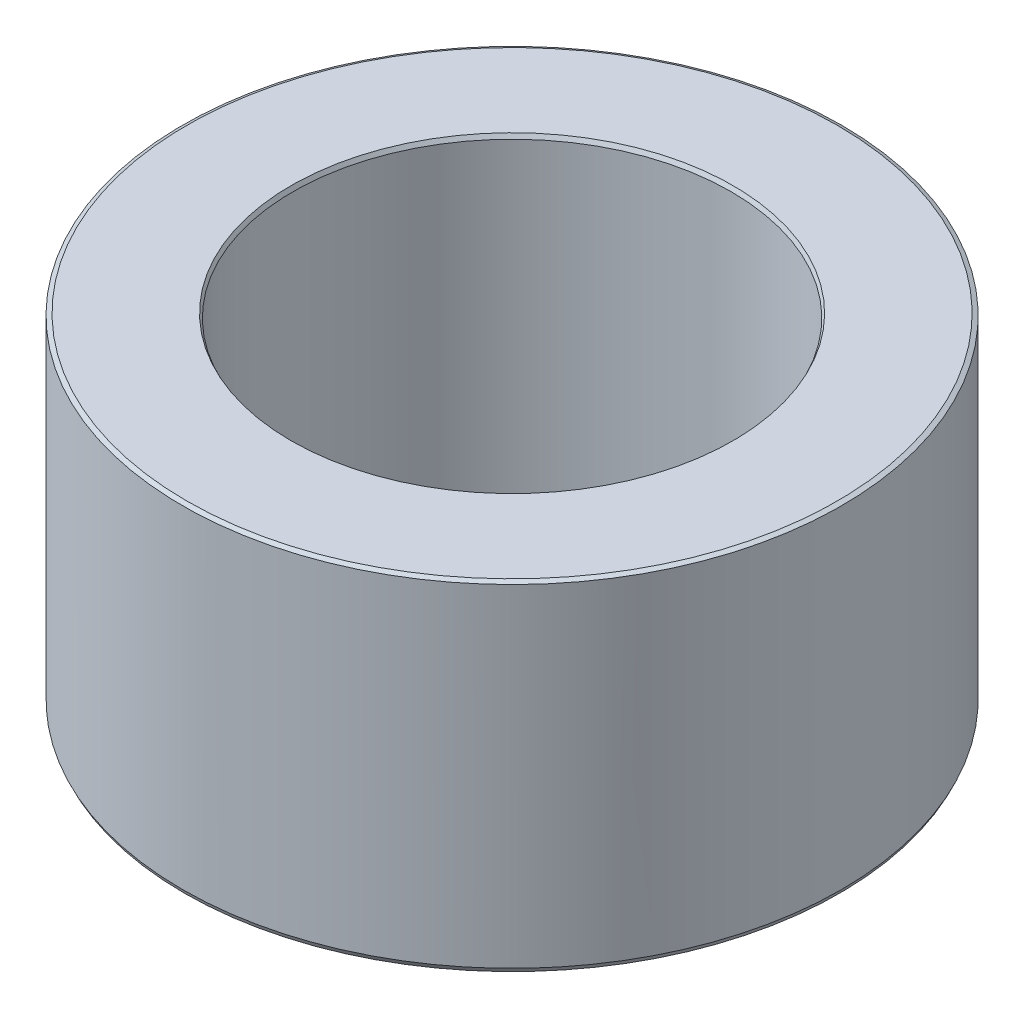
ISO-10303-21;
HEADER;
FILE_DESCRIPTION(('STEP AP214'),'2;1');
FILE_NAME('part.step','',(''),(''),'','','');
FILE_SCHEMA(('AUTOMOTIVE_DESIGN { 1 0 10303 214 1 1 1 1 }'));
ENDSEC;
DATA;
#1=APPLICATION_CONTEXT('core data for automotive mechanical design processes');
#2=APPLICATION_PROTOCOL_DEFINITION('international standard','automotive_design',2000,#1);
#3=PRODUCT_CONTEXT('',#1,'mechanical');
#4=PRODUCT('Part','Part','',(#3));
#5=PRODUCT_RELATED_PRODUCT_CATEGORY('part','',(#4));
#6=PRODUCT_DEFINITION_FORMATION('','',#4);
#7=PRODUCT_DEFINITION_CONTEXT('part definition',#1,'design');
#8=PRODUCT_DEFINITION('design','',#6,#7);
#9=PRODUCT_DEFINITION_SHAPE('','',#8);
#10=(LENGTH_UNIT() NAMED_UNIT(*) SI_UNIT(.MILLI.,.METRE.));
#11=(NAMED_UNIT(*) PLANE_ANGLE_UNIT() SI_UNIT($,.RADIAN.));
#12=(NAMED_UNIT(*) SI_UNIT($,.STERADIAN.) SOLID_ANGLE_UNIT());
#13=UNCERTAINTY_MEASURE_WITH_UNIT(LENGTH_MEASURE(1.E-05),#10,'distance_accuracy_value','');
#14=(GEOMETRIC_REPRESENTATION_CONTEXT(3) GLOBAL_UNCERTAINTY_ASSIGNED_CONTEXT((#13)) GLOBAL_UNIT_ASSIGNED_CONTEXT((#10,
#11,#12)) REPRESENTATION_CONTEXT('',''));
#15=CARTESIAN_POINT('',(0.,0.,0.));
#16=DIRECTION('',(0.,0.,1.));
#17=DIRECTION('',(1.,0.,0.));
#18=AXIS2_PLACEMENT_3D('',#15,#16,#17);
#19=CARTESIAN_POINT('',(0.,41.0965791067413,0.));
#20=DIRECTION('',(0.,-1.,0.));
#21=DIRECTION('',(0.,0.,-1.));
#22=AXIS2_PLACEMENT_3D('',#19,#20,#21);
#23=CYLINDRICAL_SURFACE('',#22,40.);
#24=CARTESIAN_POINT('',(0.,0.514580159419575,0.));
#25=DIRECTION('',(0.,1.,0.));
#26=DIRECTION('',(0.,0.,1.));
#27=AXIS2_PLACEMENT_3D('',#24,#25,#26);
#28=CIRCLE('',#27,40.);
#29=CARTESIAN_POINT('',(0.,0.514580159419575,40.));
#30=VERTEX_POINT('',#29);
#31=EDGE_CURVE('E10',#30,#30,#28,.T.);
#32=ORIENTED_EDGE('',*,*,#31,.T.);
#33=EDGE_LOOP('',(#32));
#34=FACE_BOUND('',#33,.T.);
#35=CARTESIAN_POINT('',(0.,40.8561418525905,0.));
#36=DIRECTION('',(0.,1.,0.));
#37=DIRECTION('',(0.,0.,1.));
#38=AXIS2_PLACEMENT_3D('',#35,#36,#37);
#39=CIRCLE('',#38,40.);
#40=CARTESIAN_POINT('',(0.,40.8561418525905,-40.));
#41=VERTEX_POINT('',#40);
#42=EDGE_CURVE('E50',#41,#41,#39,.F.);
#43=ORIENTED_EDGE('',*,*,#42,.T.);
#44=EDGE_LOOP('',(#43));
#45=FACE_BOUND('',#44,.T.);
#46=ADVANCED_FACE('F39',(#34,#45),#23,.T.);
#47=CARTESIAN_POINT('',(0.,41.0965791067413,0.));
#48=DIRECTION('',(0.,1.,0.));
#49=DIRECTION('',(0.,0.,1.));
#50=AXIS2_PLACEMENT_3D('',#47,#48,#49);
#51=PLANE('',#50);
#52=CARTESIAN_POINT('',(0.,41.0965791067413,0.));
#53=DIRECTION('',(0.,1.,0.));
#54=DIRECTION('',(0.,0.,1.));
#55=AXIS2_PLACEMENT_3D('',#52,#53,#54);
#56=CIRCLE('',#55,26.8243624356126);
#57=CARTESIAN_POINT('',(0.,41.0965791067413,26.8243624356126));
#58=VERTEX_POINT('',#57);
#59=EDGE_CURVE('E58',#58,#58,#56,.F.);
#60=ORIENTED_EDGE('',*,*,#59,.T.);
#61=EDGE_LOOP('',(#60));
#62=FACE_BOUND('',#61,.T.);
#63=CARTESIAN_POINT('',(0.,41.0965791067413,0.));
#64=DIRECTION('',(0.,1.,0.));
#65=DIRECTION('',(0.,0.,1.));
#66=AXIS2_PLACEMENT_3D('',#63,#64,#65);
#67=CIRCLE('',#66,39.4854198405805);
#68=CARTESIAN_POINT('',(0.,41.0965791067413,-39.4854198405805));
#69=VERTEX_POINT('',#68);
#70=EDGE_CURVE('E61',#69,#69,#67,.T.);
#71=ORIENTED_EDGE('',*,*,#70,.T.);
#72=EDGE_LOOP('',(#71));
#73=FACE_BOUND('',#72,.T.);
#74=ADVANCED_FACE('F88',(#62,#73),#51,.T.);
#75=CARTESIAN_POINT('',(0.,0.,0.));
#76=DIRECTION('',(0.,1.,0.));
#77=DIRECTION('',(0.,0.,1.));
#78=AXIS2_PLACEMENT_3D('',#75,#76,#77);
#79=PLANE('',#78);
#80=CARTESIAN_POINT('',(0.,0.,0.));
#81=DIRECTION('',(0.,1.,0.));
#82=DIRECTION('',(0.,0.,1.));
#83=AXIS2_PLACEMENT_3D('',#80,#81,#82);
#84=CIRCLE('',#83,27.0985053408813);
#85=CARTESIAN_POINT('',(0.,0.,-27.0985053408813));
#86=VERTEX_POINT('',#85);
#87=EDGE_CURVE('E51',#86,#86,#84,.T.);
#88=ORIENTED_EDGE('',*,*,#87,.T.);
#89=EDGE_LOOP('',(#88));
#90=FACE_BOUND('',#89,.T.);
#91=CARTESIAN_POINT('',(0.,0.,0.));
#92=DIRECTION('',(0.,1.,0.));
#93=DIRECTION('',(0.,0.,1.));
#94=AXIS2_PLACEMENT_3D('',#91,#92,#93);
#95=CIRCLE('',#94,39.7595627458491);
#96=CARTESIAN_POINT('',(0.,0.,39.7595627458491));
#97=VERTEX_POINT('',#96);
#98=EDGE_CURVE('E54',#97,#97,#95,.F.);
#99=ORIENTED_EDGE('',*,*,#98,.T.);
#100=EDGE_LOOP('',(#99));
#101=FACE_BOUND('',#100,.T.);
#102=ADVANCED_FACE('F83',(#90,#101),#79,.F.);
#103=CARTESIAN_POINT('',(0.,41.0965791067413,0.));
#104=DIRECTION('',(0.,-1.,0.));
#105=DIRECTION('',(0.,0.,-1.));
#106=AXIS2_PLACEMENT_3D('',#103,#104,#105);
#107=CYLINDRICAL_SURFACE('',#106,26.5839251814618);
#108=CARTESIAN_POINT('',(0.,40.5819989473218,0.));
#109=DIRECTION('',(0.,1.,0.));
#110=DIRECTION('',(0.,0.,1.));
#111=AXIS2_PLACEMENT_3D('',#108,#109,#110);
#112=CIRCLE('',#111,26.5839251814618);
#113=CARTESIAN_POINT('',(0.,40.5819989473218,26.5839251814618));
#114=VERTEX_POINT('',#113);
#115=EDGE_CURVE('E67',#114,#114,#112,.T.);
#116=ORIENTED_EDGE('',*,*,#115,.T.);
#117=EDGE_LOOP('',(#116));
#118=FACE_BOUND('',#117,.T.);
#119=CARTESIAN_POINT('',(0.,0.240437254150842,0.));
#120=DIRECTION('',(0.,1.,0.));
#121=DIRECTION('',(0.,0.,1.));
#122=AXIS2_PLACEMENT_3D('',#119,#120,#121);
#123=CIRCLE('',#122,26.5839251814618);
#124=CARTESIAN_POINT('',(0.,0.240437254150842,-26.5839251814618));
#125=VERTEX_POINT('',#124);
#126=EDGE_CURVE('E69',#125,#125,#123,.F.);
#127=ORIENTED_EDGE('',*,*,#126,.T.);
#128=EDGE_LOOP('',(#127));
#129=FACE_BOUND('',#128,.T.);
#130=ADVANCED_FACE('F71',(#118,#129),#107,.F.);
#131=CARTESIAN_POINT('',(0.,40.5819989473218,0.));
#132=DIRECTION('',(0.,1.,0.));
#133=DIRECTION('',(0.,0.,1.));
#134=AXIS2_PLACEMENT_3D('',#131,#132,#133);
#135=CONICAL_SURFACE('',#134,26.5839251814618,0.43710554837761);
#136=ORIENTED_EDGE('',*,*,#59,.F.);
#137=EDGE_LOOP('',(#136));
#138=FACE_BOUND('',#137,.T.);
#139=ORIENTED_EDGE('',*,*,#115,.F.);
#140=EDGE_LOOP('',(#139));
#141=FACE_BOUND('',#140,.T.);
#142=ADVANCED_FACE('F77',(#138,#141),#135,.F.);
#143=CARTESIAN_POINT('',(0.,0.,0.));
#144=DIRECTION('',(0.,-1.,0.));
#145=DIRECTION('',(0.,0.,-1.));
#146=AXIS2_PLACEMENT_3D('',#143,#144,#145);
#147=CONICAL_SURFACE('',#146,27.0985053408813,1.1336907784173);
#148=CARTESIAN_POINT('',(0.,0.240437254150842,-26.5839251814618));
#149=CARTESIAN_POINT('',(0.,0.237932699420104,-26.5892853914557));
#150=CARTESIAN_POINT('',(0.,0.235428144689366,-26.5946456014497));
#151=CARTESIAN_POINT('',(0.,0.230419035227891,-26.6053660214376));
#152=CARTESIAN_POINT('',(0.,0.227914480497153,-26.6107262314315));
#153=CARTESIAN_POINT('',(0.,0.222905371035677,-26.6214466514194));
#154=CARTESIAN_POINT('',(0.,0.220400816304939,-26.6268068614134));
#155=CARTESIAN_POINT('',(0.,0.215391706843463,-26.6375272814013));
#156=CARTESIAN_POINT('',(0.,0.212887152112725,-26.6428874913953));
#157=CARTESIAN_POINT('',(0.,0.207878042651249,-26.6536079113832));
#158=CARTESIAN_POINT('',(0.,0.205373487920511,-26.6589681213771));
#159=CARTESIAN_POINT('',(0.,0.200364378459035,-26.669688541365));
#160=CARTESIAN_POINT('',(0.,0.197859823728297,-26.675048751359));
#161=CARTESIAN_POINT('',(0.,0.192850714266822,-26.6857691713469));
#162=CARTESIAN_POINT('',(0.,0.190346159536084,-26.6911293813408));
#163=CARTESIAN_POINT('',(0.,0.185337050074608,-26.7018498013287));
#164=CARTESIAN_POINT('',(0.,0.18283249534387,-26.7072100113227));
#165=CARTESIAN_POINT('',(0.,0.177823385882394,-26.7179304313106));
#166=CARTESIAN_POINT('',(0.,0.175318831151656,-26.7232906413046));
#167=CARTESIAN_POINT('',(0.,0.17030972169018,-26.7340110612925));
#168=CARTESIAN_POINT('',(0.,0.167805166959442,-26.7393712712864));
#169=CARTESIAN_POINT('',(0.,0.162796057497966,-26.7500916912743));
#170=CARTESIAN_POINT('',(0.,0.160291502767228,-26.7554519012683));
#171=CARTESIAN_POINT('',(0.,0.155282393305752,-26.7661723212562));
#172=CARTESIAN_POINT('',(0.,0.152777838575014,-26.7715325312501));
#173=CARTESIAN_POINT('',(0.,0.147768729113538,-26.7822529512381));
#174=CARTESIAN_POINT('',(0.,0.1452641743828,-26.787613161232));
#175=CARTESIAN_POINT('',(0.,0.140255064921325,-26.7983335812199));
#176=CARTESIAN_POINT('',(0.,0.137750510190587,-26.8036937912139));
#177=CARTESIAN_POINT('',(0.,0.132741400729111,-26.8144142112018));
#178=CARTESIAN_POINT('',(0.,0.130236845998373,-26.8197744211957));
#179=CARTESIAN_POINT('',(0.,0.125227736536897,-26.8304948411836));
#180=CARTESIAN_POINT('',(0.,0.122723181806159,-26.8358550511776));
#181=CARTESIAN_POINT('',(0.,0.117714072344683,-26.8465754711655));
#182=CARTESIAN_POINT('',(0.,0.115209517613945,-26.8519356811595));
#183=CARTESIAN_POINT('',(0.,0.110200408152469,-26.8626561011474));
#184=CARTESIAN_POINT('',(0.,0.107695853421732,-26.8680163111413));
#185=CARTESIAN_POINT('',(0.,0.102686743960256,-26.8787367311292));
#186=CARTESIAN_POINT('',(0.,0.100182189229518,-26.8840969411232));
#187=CARTESIAN_POINT('',(0.,0.0951730797680417,-26.8948173611111));
#188=CARTESIAN_POINT('',(0.,0.0926685250373039,-26.900177571105));
#189=CARTESIAN_POINT('',(0.,0.0876594155758279,-26.9108979910929));
#190=CARTESIAN_POINT('',(0.,0.0851548608450897,-26.9162582010869));
#191=CARTESIAN_POINT('',(0.,0.0801457513836139,-26.9269786210748));
#192=CARTESIAN_POINT('',(0.,0.0776411966528763,-26.9323388310688));
#193=CARTESIAN_POINT('',(0.,0.0726320871914005,-26.9430592510567));
#194=CARTESIAN_POINT('',(0.,0.0701275324606624,-26.9484194610506));
#195=CARTESIAN_POINT('',(0.,0.0651184229991864,-26.9591398810385));
#196=CARTESIAN_POINT('',(0.,0.0626138682684486,-26.9645000910325));
#197=CARTESIAN_POINT('',(0.,0.0576047588069726,-26.9752205110204));
#198=CARTESIAN_POINT('',(0.,0.0551002040762344,-26.9805807210143));
#199=CARTESIAN_POINT('',(0.,0.0500910946147586,-26.9913011410022));
#200=CARTESIAN_POINT('',(0.,0.047586539884021,-26.9966613509962));
#201=CARTESIAN_POINT('',(0.,0.0425774304225453,-27.0073817709841));
#202=CARTESIAN_POINT('',(0.,0.0400728756918071,-27.0127419809781));
#203=CARTESIAN_POINT('',(0.,0.0350637662303311,-27.023462400966));
#204=CARTESIAN_POINT('',(0.,0.0325592114995933,-27.0288226109599));
#205=CARTESIAN_POINT('',(0.,0.0275501020381173,-27.0395430309478));
#206=CARTESIAN_POINT('',(0.,0.0250455473073791,-27.0449032409418));
#207=CARTESIAN_POINT('',(0.,0.0200364378459034,-27.0556236609297));
#208=CARTESIAN_POINT('',(0.,0.0175318831151657,-27.0609838709236));
#209=CARTESIAN_POINT('',(0.,0.01252277365369,-27.0717042909116));
#210=CARTESIAN_POINT('',(0.,0.0100182189229519,-27.0770645009055));
#211=CARTESIAN_POINT('',(0.,0.00500910946147573,-27.0877849208934));
#212=CARTESIAN_POINT('',(0.,0.00250455473073764,-27.0931451308874));
#213=CARTESIAN_POINT('',(0.,0.,-27.0985053408813));
#214=B_SPLINE_CURVE_WITH_KNOTS('',3,(#148,#149,#150,#151,#152,#153,#154,#155,#156,#157,#158,
#159,#160,#161,#162,#163,#164,#165,#166,#167,#168,#169,#170,#171,#172,#173,#174,#175,#176,#177,
#178,#179,#180,#181,#182,#183,#184,#185,#186,#187,#188,#189,#190,#191,#192,#193,#194,#195,#196,
#197,#198,#199,#200,#201,#202,#203,#204,#205,#206,#207,#208,#209,#210,#211,#212,#213),
.UNSPECIFIED.,.F.,.F.,(4,2,2,2,2,2,2,2,2,2,2,2,2,2,2,2,2,2,2,2,2,2,2,2,2,2,2,2,2,2,2,2,4),(0.,
0.0177494171793569,0.035498834358717,0.0532482515380739,0.0709976687174309,0.0887470858967878,
0.106496503076148,0.124245920255505,0.141995337434862,0.159744754614219,0.177494171793579,
0.195243588972936,0.212993006152293,0.23074242333165,0.24849184051101,0.266241257690366,
0.283990674869723,0.30174009204908,0.31948950922844,0.337238926407797,0.354988343587154,
0.372737760766511,0.390487177945871,0.408236595125228,0.425986012304585,0.443735429483942,
0.461484846663302,0.479234263842659,0.496983681022016,0.514733098201373,0.532482515380733,
0.55023193256009,0.567981349739447),.UNSPECIFIED.);
#215=EDGE_CURVE('BSEAM73',#125,#86,#214,.T.);
#216=ORIENTED_EDGE('',*,*,#126,.F.);
#217=ORIENTED_EDGE('',*,*,#87,.F.);
#218=ORIENTED_EDGE('',*,*,#215,.T.);
#219=ORIENTED_EDGE('',*,*,#215,.F.);
#220=EDGE_LOOP('',(#216,#218,#217,#219));
#221=FACE_BOUND('',#220,.T.);
#222=ADVANCED_FACE('F73',(#221),#147,.F.);
#223=CARTESIAN_POINT('',(0.,0.514580159419575,0.));
#224=DIRECTION('',(0.,1.,0.));
#225=DIRECTION('',(0.,0.,1.));
#226=AXIS2_PLACEMENT_3D('',#223,#224,#225);
#227=CONICAL_SURFACE('',#226,40.,0.437105548377614);
#228=ORIENTED_EDGE('',*,*,#98,.F.);
#229=EDGE_LOOP('',(#228));
#230=FACE_BOUND('',#229,.T.);
#231=ORIENTED_EDGE('',*,*,#31,.F.);
#232=EDGE_LOOP('',(#231));
#233=FACE_BOUND('',#232,.T.);
#234=ADVANCED_FACE('F76',(#230,#233),#227,.T.);
#235=CARTESIAN_POINT('',(0.,41.0965791067413,0.));
#236=DIRECTION('',(0.,-1.,0.));
#237=DIRECTION('',(0.,0.,-1.));
#238=AXIS2_PLACEMENT_3D('',#235,#236,#237);
#239=CONICAL_SURFACE('',#238,39.4854198405805,1.1336907784173);
#240=CARTESIAN_POINT('',(0.,40.8561418525905,-40.));
#241=CARTESIAN_POINT('',(0.,40.8586464073212,-39.9946397900061));
#242=CARTESIAN_POINT('',(0.,40.8611509620519,-39.9892795800121));
#243=CARTESIAN_POINT('',(0.,40.8661600715134,-39.9785591600242));
#244=CARTESIAN_POINT('',(0.,40.8686646262442,-39.9731989500302));
#245=CARTESIAN_POINT('',(0.,40.8736737357056,-39.9624785300423));
#246=CARTESIAN_POINT('',(0.,40.8761782904364,-39.9571183200484));
#247=CARTESIAN_POINT('',(0.,40.8811873998978,-39.9463979000605));
#248=CARTESIAN_POINT('',(0.,40.8836919546286,-39.9410376900665));
#249=CARTESIAN_POINT('',(0.,40.88870106409,-39.9303172700786));
#250=CARTESIAN_POINT('',(0.,40.8912056188208,-39.9249570600847));
#251=CARTESIAN_POINT('',(0.,40.8962147282823,-39.9142366400968));
#252=CARTESIAN_POINT('',(0.,40.898719283013,-39.9088764301028));
#253=CARTESIAN_POINT('',(0.,40.9037283924745,-39.8981560101149));
#254=CARTESIAN_POINT('',(0.,40.9062329472052,-39.8927958001209));
#255=CARTESIAN_POINT('',(0.,40.9112420566667,-39.882075380133));
#256=CARTESIAN_POINT('',(0.,40.9137466113974,-39.8767151701391));
#257=CARTESIAN_POINT('',(0.,40.9187557208589,-39.8659947501512));
#258=CARTESIAN_POINT('',(0.,40.9212602755897,-39.8606345401572));
#259=CARTESIAN_POINT('',(0.,40.9262693850511,-39.8499141201693));
#260=CARTESIAN_POINT('',(0.,40.9287739397819,-39.8445539101754));
#261=CARTESIAN_POINT('',(0.,40.9337830492433,-39.8338334901874));
#262=CARTESIAN_POINT('',(0.,40.9362876039741,-39.8284732801935));
#263=CARTESIAN_POINT('',(0.,40.9412967134356,-39.8177528602056));
#264=CARTESIAN_POINT('',(0.,40.9438012681663,-39.8123926502116));
#265=CARTESIAN_POINT('',(0.,40.9488103776278,-39.8016722302237));
#266=CARTESIAN_POINT('',(0.,40.9513149323585,-39.7963120202298));
#267=CARTESIAN_POINT('',(0.,40.95632404182,-39.7855916002419));
#268=CARTESIAN_POINT('',(0.,40.9588285965507,-39.7802313902479));
#269=CARTESIAN_POINT('',(0.,40.9638377060122,-39.76951097026));
#270=CARTESIAN_POINT('',(0.,40.9663422607429,-39.7641507602661));
#271=CARTESIAN_POINT('',(0.,40.9713513702044,-39.7534303402781));
#272=CARTESIAN_POINT('',(0.,40.9738559249351,-39.7480701302842));
#273=CARTESIAN_POINT('',(0.,40.9788650343966,-39.7373497102963));
#274=CARTESIAN_POINT('',(0.,40.9813695891274,-39.7319895003023));
#275=CARTESIAN_POINT('',(0.,40.9863786985888,-39.7212690803144));
#276=CARTESIAN_POINT('',(0.,40.9888832533196,-39.7159088703205));
#277=CARTESIAN_POINT('',(0.,40.9938923627811,-39.7051884503326));
#278=CARTESIAN_POINT('',(0.,40.9963969175118,-39.6998282403386));
#279=CARTESIAN_POINT('',(0.,41.0014060269733,-39.6891078203507));
#280=CARTESIAN_POINT('',(0.,41.003910581704,-39.6837476103567));
#281=CARTESIAN_POINT('',(0.,41.0089196911655,-39.6730271903688));
#282=CARTESIAN_POINT('',(0.,41.0114242458962,-39.6676669803749));
#283=CARTESIAN_POINT('',(0.,41.0164333553577,-39.656946560387));
#284=CARTESIAN_POINT('',(0.,41.0189379100884,-39.651586350393));
#285=CARTESIAN_POINT('',(0.,41.0239470195499,-39.6408659304051));
#286=CARTESIAN_POINT('',(0.,41.0264515742806,-39.6355057204112));
#287=CARTESIAN_POINT('',(0.,41.0314606837421,-39.6247853004233));
#288=CARTESIAN_POINT('',(0.,41.0339652384729,-39.6194250904293));
#289=CARTESIAN_POINT('',(0.,41.0389743479343,-39.6087046704414));
#290=CARTESIAN_POINT('',(0.,41.0414789026651,-39.6033444604475));
#291=CARTESIAN_POINT('',(0.,41.0464880121265,-39.5926240404595));
#292=CARTESIAN_POINT('',(0.,41.0489925668573,-39.5872638304656));
#293=CARTESIAN_POINT('',(0.,41.0540016763188,-39.5765434104777));
#294=CARTESIAN_POINT('',(0.,41.0565062310495,-39.5711832004837));
#295=CARTESIAN_POINT('',(0.,41.061515340511,-39.5604627804958));
#296=CARTESIAN_POINT('',(0.,41.0640198952417,-39.5551025705019));
#297=CARTESIAN_POINT('',(0.,41.0690290047032,-39.544382150514));
#298=CARTESIAN_POINT('',(0.,41.0715335594339,-39.53902194052));
#299=CARTESIAN_POINT('',(0.,41.0765426688954,-39.5283015205321));
#300=CARTESIAN_POINT('',(0.,41.0790472236261,-39.5229413105381));
#301=CARTESIAN_POINT('',(0.,41.0840563330876,-39.5122208905502));
#302=CARTESIAN_POINT('',(0.,41.0865608878184,-39.5068606805563));
#303=CARTESIAN_POINT('',(0.,41.0915699972798,-39.4961402605684));
#304=CARTESIAN_POINT('',(0.,41.0940745520106,-39.4907800505744));
#305=CARTESIAN_POINT('',(0.,41.0965791067413,-39.4854198405805));
#306=B_SPLINE_CURVE_WITH_KNOTS('',3,(#240,#241,#242,#243,#244,#245,#246,#247,#248,#249,#250,
#251,#252,#253,#254,#255,#256,#257,#258,#259,#260,#261,#262,#263,#264,#265,#266,#267,#268,#269,
#270,#271,#272,#273,#274,#275,#276,#277,#278,#279,#280,#281,#282,#283,#284,#285,#286,#287,#288,
#289,#290,#291,#292,#293,#294,#295,#296,#297,#298,#299,#300,#301,#302,#303,#304,#305),
.UNSPECIFIED.,.F.,.F.,(4,2,2,2,2,2,2,2,2,2,2,2,2,2,2,2,2,2,2,2,2,2,2,2,2,2,2,2,2,2,2,2,4),(0.,
0.0177494171793578,0.0354988343587155,0.0532482515380733,0.0709976687174281,0.0887470858967858,
0.106496503076144,0.124245920255505,0.141995337434862,0.15974475461422,0.177494171793575,
0.195243588972933,0.21299300615229,0.230742423331645,0.248491840511003,0.266241257690361,
0.283990674869716,0.30174009204908,0.319489509228437,0.337238926407795,0.35498834358715,
0.372737760766508,0.390487177945865,0.40823659512522,0.425986012304578,0.443735429483936,
0.461484846663291,0.479234263842648,0.496983681022012,0.514733098201367,0.532482515380725,
0.550231932560083,0.56798134973944),.UNSPECIFIED.);
#307=EDGE_CURVE('BSEAM45',#41,#69,#306,.T.);
#308=ORIENTED_EDGE('',*,*,#42,.F.);
#309=ORIENTED_EDGE('',*,*,#70,.F.);
#310=ORIENTED_EDGE('',*,*,#307,.T.);
#311=ORIENTED_EDGE('',*,*,#307,.F.);
#312=EDGE_LOOP('',(#308,#310,#309,#311));
#313=FACE_BOUND('',#312,.T.);
#314=ADVANCED_FACE('F45',(#313),#239,.T.);
#315=CLOSED_SHELL('',(#46,#74,#102,#130,#142,#222,#234,#314));
#316=MANIFOLD_SOLID_BREP('B2',#315);
#317=ADVANCED_BREP_SHAPE_REPRESENTATION('',(#18,#316),#14);
#318=SHAPE_DEFINITION_REPRESENTATION(#9,#317);
ENDSEC;
END-ISO-10303-21;
